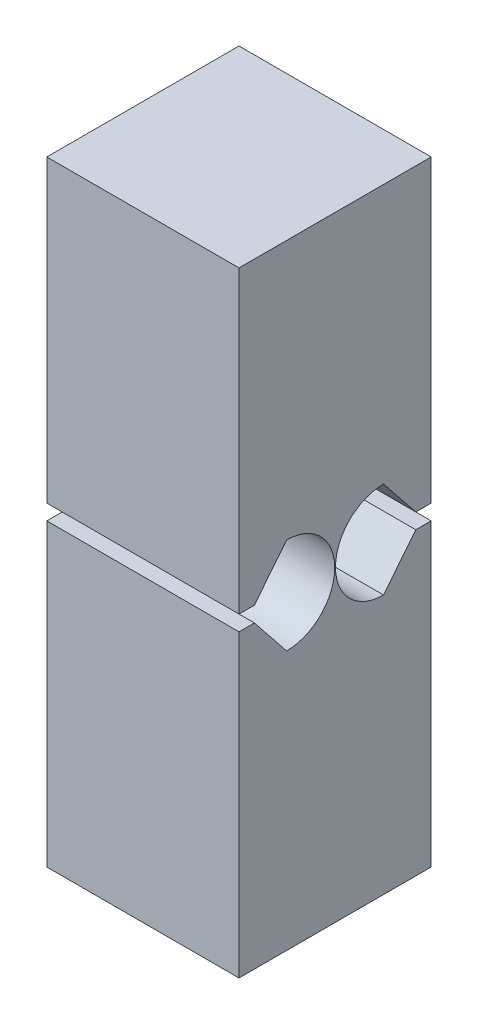
ISO-10303-21;
HEADER;
FILE_DESCRIPTION(('STEP AP214'),'2;1');
FILE_NAME('part.step','',(''),(''),'','','');
FILE_SCHEMA(('AUTOMOTIVE_DESIGN { 1 0 10303 214 1 1 1 1 }'));
ENDSEC;
DATA;
#1=APPLICATION_CONTEXT('core data for automotive mechanical design processes');
#2=APPLICATION_PROTOCOL_DEFINITION('international standard','automotive_design',2000,#1);
#3=PRODUCT_CONTEXT('',#1,'mechanical');
#4=PRODUCT('Part','Part','',(#3));
#5=PRODUCT_RELATED_PRODUCT_CATEGORY('part','',(#4));
#6=PRODUCT_DEFINITION_FORMATION('','',#4);
#7=PRODUCT_DEFINITION_CONTEXT('part definition',#1,'design');
#8=PRODUCT_DEFINITION('design','',#6,#7);
#9=PRODUCT_DEFINITION_SHAPE('','',#8);
#10=(LENGTH_UNIT() NAMED_UNIT(*) SI_UNIT(.MILLI.,.METRE.));
#11=(NAMED_UNIT(*) PLANE_ANGLE_UNIT() SI_UNIT($,.RADIAN.));
#12=(NAMED_UNIT(*) SI_UNIT($,.STERADIAN.) SOLID_ANGLE_UNIT());
#13=UNCERTAINTY_MEASURE_WITH_UNIT(LENGTH_MEASURE(1.E-05),#10,'distance_accuracy_value','');
#14=(GEOMETRIC_REPRESENTATION_CONTEXT(3) GLOBAL_UNCERTAINTY_ASSIGNED_CONTEXT((#13)) GLOBAL_UNIT_ASSIGNED_CONTEXT((#10,
#11,#12)) REPRESENTATION_CONTEXT('',''));
#15=CARTESIAN_POINT('',(0.,0.,0.));
#16=DIRECTION('',(0.,0.,1.));
#17=DIRECTION('',(1.,0.,0.));
#18=AXIS2_PLACEMENT_3D('',#15,#16,#17);
#19=CARTESIAN_POINT('',(-3.175,10.16,-3.175));
#20=DIRECTION('',(1.,0.,0.));
#21=DIRECTION('',(0.,0.,-1.));
#22=AXIS2_PLACEMENT_3D('',#19,#20,#21);
#23=PLANE('',#22);
#24=DIRECTION('',(0.,0.,1.));
#25=VECTOR('',#24,1.);
#26=CARTESIAN_POINT('',(-3.175,0.254,-3.175));
#27=LINE('',#26,#25);
#28=CARTESIAN_POINT('',(-3.175,0.254000000000001,-3.175));
#29=VERTEX_POINT('',#28);
#30=CARTESIAN_POINT('',(-3.175,0.254,-2.667));
#31=VERTEX_POINT('',#30);
#32=EDGE_CURVE('E146',#29,#31,#27,.T.);
#33=ORIENTED_EDGE('',*,*,#32,.T.);
#34=DIRECTION('',(0.,0.78086880944303,0.624695047554424));
#35=VECTOR('',#34,1.);
#36=CARTESIAN_POINT('',(-3.175,0.254,-2.667));
#37=LINE('',#36,#35);
#38=CARTESIAN_POINT('',(-3.175,1.5875,-1.6002));
#39=VERTEX_POINT('',#38);
#40=EDGE_CURVE('E157',#31,#39,#37,.T.);
#41=ORIENTED_EDGE('',*,*,#40,.T.);
#42=CARTESIAN_POINT('',(-3.175,0.,-1.6002));
#43=DIRECTION('',(1.,0.,0.));
#44=DIRECTION('',(0.,0.,-1.));
#45=AXIS2_PLACEMENT_3D('',#42,#43,#44);
#46=CIRCLE('',#45,1.5875);
#47=CARTESIAN_POINT('',(-3.175,-1.5875,-1.6002));
#48=VERTEX_POINT('',#47);
#49=EDGE_CURVE('E281',#39,#48,#46,.T.);
#50=ORIENTED_EDGE('',*,*,#49,.T.);
#51=DIRECTION('',(0.,0.78086880944303,-0.624695047554424));
#52=VECTOR('',#51,1.);
#53=CARTESIAN_POINT('',(-3.175,-0.254,-2.667));
#54=LINE('',#53,#52);
#55=CARTESIAN_POINT('',(-3.175,-0.254,-2.667));
#56=VERTEX_POINT('',#55);
#57=EDGE_CURVE('E258',#48,#56,#54,.T.);
#58=ORIENTED_EDGE('',*,*,#57,.T.);
#59=DIRECTION('',(0.,0.,-1.));
#60=VECTOR('',#59,1.);
#61=CARTESIAN_POINT('',(-3.175,-0.254,-3.175));
#62=LINE('',#61,#60);
#63=CARTESIAN_POINT('',(-3.175,-0.254000000000001,-3.175));
#64=VERTEX_POINT('',#63);
#65=EDGE_CURVE('E284',#56,#64,#62,.T.);
#66=ORIENTED_EDGE('',*,*,#65,.T.);
#67=DIRECTION('',(0.,-1.,0.));
#68=VECTOR('',#67,1.);
#69=CARTESIAN_POINT('',(-3.175,10.16,-3.175));
#70=LINE('',#69,#68);
#71=CARTESIAN_POINT('',(-3.175,-10.16,-3.175));
#72=VERTEX_POINT('',#71);
#73=EDGE_CURVE('E174',#64,#72,#70,.T.);
#74=ORIENTED_EDGE('',*,*,#73,.T.);
#75=DIRECTION('',(0.,0.,1.));
#76=VECTOR('',#75,1.);
#77=CARTESIAN_POINT('',(-3.175,-10.16,-3.175));
#78=LINE('',#77,#76);
#79=CARTESIAN_POINT('',(-3.175,-10.16,3.175));
#80=VERTEX_POINT('',#79);
#81=EDGE_CURVE('E209',#72,#80,#78,.T.);
#82=ORIENTED_EDGE('',*,*,#81,.T.);
#83=DIRECTION('',(0.,-1.,0.));
#84=VECTOR('',#83,1.);
#85=CARTESIAN_POINT('',(-3.175,10.16,3.175));
#86=LINE('',#85,#84);
#87=CARTESIAN_POINT('',(-3.175,-0.254,3.175));
#88=VERTEX_POINT('',#87);
#89=EDGE_CURVE('E41',#88,#80,#86,.T.);
#90=ORIENTED_EDGE('',*,*,#89,.F.);
#91=DIRECTION('',(0.,0.,1.));
#92=VECTOR('',#91,1.);
#93=CARTESIAN_POINT('',(-3.175,-0.254,3.175));
#94=LINE('',#93,#92);
#95=CARTESIAN_POINT('',(-3.175,-0.254,2.667));
#96=VERTEX_POINT('',#95);
#97=EDGE_CURVE('E247',#96,#88,#94,.T.);
#98=ORIENTED_EDGE('',*,*,#97,.F.);
#99=DIRECTION('',(0.,0.78086880944303,0.624695047554424));
#100=VECTOR('',#99,1.);
#101=CARTESIAN_POINT('',(-3.175,-0.254,2.667));
#102=LINE('',#101,#100);
#103=CARTESIAN_POINT('',(-3.175,-1.5875,1.6002));
#104=VERTEX_POINT('',#103);
#105=EDGE_CURVE('E249',#104,#96,#102,.T.);
#106=ORIENTED_EDGE('',*,*,#105,.F.);
#107=CARTESIAN_POINT('',(-3.175,0.,1.6002));
#108=DIRECTION('',(1.,0.,0.));
#109=DIRECTION('',(0.,0.,-1.));
#110=AXIS2_PLACEMENT_3D('',#107,#108,#109);
#111=CIRCLE('',#110,1.5875);
#112=CARTESIAN_POINT('',(-3.175,1.5875,1.6002));
#113=VERTEX_POINT('',#112);
#114=EDGE_CURVE('E252',#113,#104,#111,.F.);
#115=ORIENTED_EDGE('',*,*,#114,.F.);
#116=DIRECTION('',(0.,0.78086880944303,-0.624695047554424));
#117=VECTOR('',#116,1.);
#118=CARTESIAN_POINT('',(-3.175,0.254,2.667));
#119=LINE('',#118,#117);
#120=CARTESIAN_POINT('',(-3.175,0.254,2.667));
#121=VERTEX_POINT('',#120);
#122=EDGE_CURVE('E215',#121,#113,#119,.T.);
#123=ORIENTED_EDGE('',*,*,#122,.F.);
#124=DIRECTION('',(0.,0.,-1.));
#125=VECTOR('',#124,1.);
#126=CARTESIAN_POINT('',(-3.175,0.254,3.175));
#127=LINE('',#126,#125);
#128=CARTESIAN_POINT('',(-3.175,0.254,3.175));
#129=VERTEX_POINT('',#128);
#130=EDGE_CURVE('E255',#129,#121,#127,.T.);
#131=ORIENTED_EDGE('',*,*,#130,.F.);
#132=CARTESIAN_POINT('',(-3.175,10.16,3.175));
#133=VERTEX_POINT('',#132);
#134=EDGE_CURVE('E11',#133,#129,#86,.T.);
#135=ORIENTED_EDGE('',*,*,#134,.F.);
#136=DIRECTION('',(0.,0.,1.));
#137=VECTOR('',#136,1.);
#138=CARTESIAN_POINT('',(-3.175,10.16,-3.175));
#139=LINE('',#138,#137);
#140=CARTESIAN_POINT('',(-3.175,10.16,-3.175));
#141=VERTEX_POINT('',#140);
#142=EDGE_CURVE('E172',#141,#133,#139,.T.);
#143=ORIENTED_EDGE('',*,*,#142,.F.);
#144=EDGE_CURVE('E164',#141,#29,#70,.T.);
#145=ORIENTED_EDGE('',*,*,#144,.T.);
#146=EDGE_LOOP('',(#33,#41,#50,#58,#66,#74,#82,#90,#98,#106,#115,#123,#131,#135,#143,#145));
#147=FACE_BOUND('',#146,.T.);
#148=ADVANCED_FACE('F34',(#147),#23,.F.);
#149=CARTESIAN_POINT('',(3.175,10.16,-3.175));
#150=DIRECTION('',(-1.,0.,0.));
#151=DIRECTION('',(0.,0.,1.));
#152=AXIS2_PLACEMENT_3D('',#149,#150,#151);
#153=PLANE('',#152);
#154=DIRECTION('',(0.,0.,-1.));
#155=VECTOR('',#154,1.);
#156=CARTESIAN_POINT('',(3.175,0.254,-3.175));
#157=LINE('',#156,#155);
#158=CARTESIAN_POINT('',(3.175,0.254,-2.667));
#159=VERTEX_POINT('',#158);
#160=CARTESIAN_POINT('',(3.175,0.254,-3.175));
#161=VERTEX_POINT('',#160);
#162=EDGE_CURVE('E272',#159,#161,#157,.T.);
#163=ORIENTED_EDGE('',*,*,#162,.T.);
#164=DIRECTION('',(0.,-1.,0.));
#165=VECTOR('',#164,1.);
#166=CARTESIAN_POINT('',(3.175,10.16,-3.175));
#167=LINE('',#166,#165);
#168=CARTESIAN_POINT('',(3.175,10.16,-3.175));
#169=VERTEX_POINT('',#168);
#170=EDGE_CURVE('E167',#169,#161,#167,.T.);
#171=ORIENTED_EDGE('',*,*,#170,.F.);
#172=DIRECTION('',(0.,0.,-1.));
#173=VECTOR('',#172,1.);
#174=CARTESIAN_POINT('',(3.175,10.16,-3.175));
#175=LINE('',#174,#173);
#176=CARTESIAN_POINT('',(3.175,10.16,3.175));
#177=VERTEX_POINT('',#176);
#178=EDGE_CURVE('E217',#177,#169,#175,.T.);
#179=ORIENTED_EDGE('',*,*,#178,.F.);
#180=DIRECTION('',(0.,-1.,0.));
#181=VECTOR('',#180,1.);
#182=CARTESIAN_POINT('',(3.175,10.16,3.175));
#183=LINE('',#182,#181);
#184=CARTESIAN_POINT('',(3.175,0.254,3.175));
#185=VERTEX_POINT('',#184);
#186=EDGE_CURVE('E182',#177,#185,#183,.T.);
#187=ORIENTED_EDGE('',*,*,#186,.T.);
#188=DIRECTION('',(0.,0.,1.));
#189=VECTOR('',#188,1.);
#190=CARTESIAN_POINT('',(3.175,0.254,3.175));
#191=LINE('',#190,#189);
#192=CARTESIAN_POINT('',(3.175,0.254,2.667));
#193=VERTEX_POINT('',#192);
#194=EDGE_CURVE('E241',#193,#185,#191,.T.);
#195=ORIENTED_EDGE('',*,*,#194,.F.);
#196=DIRECTION('',(0.,-0.78086880944303,0.624695047554424));
#197=VECTOR('',#196,1.);
#198=CARTESIAN_POINT('',(3.175,0.254,2.667));
#199=LINE('',#198,#197);
#200=CARTESIAN_POINT('',(3.175,1.5875,1.6002));
#201=VERTEX_POINT('',#200);
#202=EDGE_CURVE('E243',#201,#193,#199,.T.);
#203=ORIENTED_EDGE('',*,*,#202,.F.);
#204=CARTESIAN_POINT('',(3.175,0.,1.6002));
#205=DIRECTION('',(1.,0.,0.));
#206=DIRECTION('',(0.,0.,1.));
#207=AXIS2_PLACEMENT_3D('',#204,#205,#206);
#208=CIRCLE('',#207,1.5875);
#209=CARTESIAN_POINT('',(3.175,-1.5875,1.6002));
#210=VERTEX_POINT('',#209);
#211=EDGE_CURVE('E56',#210,#201,#208,.T.);
#212=ORIENTED_EDGE('',*,*,#211,.F.);
#213=DIRECTION('',(0.,-0.78086880944303,-0.624695047554424));
#214=VECTOR('',#213,1.);
#215=CARTESIAN_POINT('',(3.175,-0.254,2.667));
#216=LINE('',#215,#214);
#217=CARTESIAN_POINT('',(3.175,-0.254,2.667));
#218=VERTEX_POINT('',#217);
#219=EDGE_CURVE('E228',#218,#210,#216,.T.);
#220=ORIENTED_EDGE('',*,*,#219,.F.);
#221=DIRECTION('',(0.,0.,-1.));
#222=VECTOR('',#221,1.);
#223=CARTESIAN_POINT('',(3.175,-0.254,3.175));
#224=LINE('',#223,#222);
#225=CARTESIAN_POINT('',(3.175,-0.254,3.175));
#226=VERTEX_POINT('',#225);
#227=EDGE_CURVE('E199',#226,#218,#224,.T.);
#228=ORIENTED_EDGE('',*,*,#227,.F.);
#229=CARTESIAN_POINT('',(3.175,-10.16,3.175));
#230=VERTEX_POINT('',#229);
#231=EDGE_CURVE('E181',#226,#230,#183,.T.);
#232=ORIENTED_EDGE('',*,*,#231,.T.);
#233=DIRECTION('',(0.,0.,-1.));
#234=VECTOR('',#233,1.);
#235=CARTESIAN_POINT('',(3.175,-10.16,-3.175));
#236=LINE('',#235,#234);
#237=CARTESIAN_POINT('',(3.175,-10.16,-3.175));
#238=VERTEX_POINT('',#237);
#239=EDGE_CURVE('E195',#230,#238,#236,.T.);
#240=ORIENTED_EDGE('',*,*,#239,.T.);
#241=CARTESIAN_POINT('',(3.175,-0.254000000000001,-3.175));
#242=VERTEX_POINT('',#241);
#243=EDGE_CURVE('E173',#242,#238,#167,.T.);
#244=ORIENTED_EDGE('',*,*,#243,.F.);
#245=DIRECTION('',(0.,0.,1.));
#246=VECTOR('',#245,1.);
#247=CARTESIAN_POINT('',(3.175,-0.254,-3.175));
#248=LINE('',#247,#246);
#249=CARTESIAN_POINT('',(3.175,-0.254,-2.667));
#250=VERTEX_POINT('',#249);
#251=EDGE_CURVE('E48',#242,#250,#248,.T.);
#252=ORIENTED_EDGE('',*,*,#251,.T.);
#253=DIRECTION('',(0.,-0.78086880944303,0.624695047554424));
#254=VECTOR('',#253,1.);
#255=CARTESIAN_POINT('',(3.175,-0.254,-2.667));
#256=LINE('',#255,#254);
#257=CARTESIAN_POINT('',(3.175,-1.5875,-1.6002));
#258=VERTEX_POINT('',#257);
#259=EDGE_CURVE('E275',#250,#258,#256,.T.);
#260=ORIENTED_EDGE('',*,*,#259,.T.);
#261=CARTESIAN_POINT('',(3.175,0.,-1.6002));
#262=DIRECTION('',(-1.,0.,0.));
#263=DIRECTION('',(0.,0.,-1.));
#264=AXIS2_PLACEMENT_3D('',#261,#262,#263);
#265=CIRCLE('',#264,1.5875);
#266=CARTESIAN_POINT('',(3.175,1.5875,-1.6002));
#267=VERTEX_POINT('',#266);
#268=EDGE_CURVE('E156',#258,#267,#265,.T.);
#269=ORIENTED_EDGE('',*,*,#268,.T.);
#270=DIRECTION('',(0.,-0.78086880944303,-0.624695047554424));
#271=VECTOR('',#270,1.);
#272=CARTESIAN_POINT('',(3.175,0.254,-2.667));
#273=LINE('',#272,#271);
#274=EDGE_CURVE('E265',#267,#159,#273,.T.);
#275=ORIENTED_EDGE('',*,*,#274,.T.);
#276=EDGE_LOOP('',(#163,#171,#179,#187,#195,#203,#212,#220,#228,#232,#240,#244,#252,#260,#269,#275));
#277=FACE_BOUND('',#276,.T.);
#278=ADVANCED_FACE('F192',(#277),#153,.F.);
#279=CARTESIAN_POINT('',(-3.175,10.16,-3.175));
#280=DIRECTION('',(0.,0.,1.));
#281=DIRECTION('',(1.,0.,0.));
#282=AXIS2_PLACEMENT_3D('',#279,#280,#281);
#283=PLANE('',#282);
#284=DIRECTION('',(1.,0.,0.));
#285=VECTOR('',#284,1.);
#286=CARTESIAN_POINT('',(-3.176,0.254,-3.175));
#287=LINE('',#286,#285);
#288=EDGE_CURVE('E150',#29,#161,#287,.T.);
#289=ORIENTED_EDGE('',*,*,#288,.F.);
#290=ORIENTED_EDGE('',*,*,#144,.F.);
#291=DIRECTION('',(-1.,0.,0.));
#292=VECTOR('',#291,1.);
#293=CARTESIAN_POINT('',(-3.175,10.16,-3.175));
#294=LINE('',#293,#292);
#295=EDGE_CURVE('E177',#169,#141,#294,.T.);
#296=ORIENTED_EDGE('',*,*,#295,.F.);
#297=ORIENTED_EDGE('',*,*,#170,.T.);
#298=EDGE_LOOP('',(#289,#290,#296,#297));
#299=FACE_BOUND('',#298,.T.);
#300=ADVANCED_FACE('F162',(#299),#283,.F.);
#301=DIRECTION('',(1.,0.,0.));
#302=VECTOR('',#301,1.);
#303=CARTESIAN_POINT('',(-3.176,-0.254,-3.175));
#304=LINE('',#303,#302);
#305=EDGE_CURVE('E168',#64,#242,#304,.T.);
#306=ORIENTED_EDGE('',*,*,#305,.T.);
#307=ORIENTED_EDGE('',*,*,#243,.T.);
#308=DIRECTION('',(-1.,0.,0.));
#309=VECTOR('',#308,1.);
#310=CARTESIAN_POINT('',(-3.175,-10.16,-3.175));
#311=LINE('',#310,#309);
#312=EDGE_CURVE('E179',#238,#72,#311,.T.);
#313=ORIENTED_EDGE('',*,*,#312,.T.);
#314=ORIENTED_EDGE('',*,*,#73,.F.);
#315=EDGE_LOOP('',(#306,#307,#313,#314));
#316=FACE_BOUND('',#315,.T.);
#317=ADVANCED_FACE('F289',(#316),#283,.F.);
#318=CARTESIAN_POINT('',(-3.175,10.16,3.175));
#319=DIRECTION('',(0.,0.,-1.));
#320=DIRECTION('',(-1.,0.,0.));
#321=AXIS2_PLACEMENT_3D('',#318,#319,#320);
#322=PLANE('',#321);
#323=ORIENTED_EDGE('',*,*,#231,.F.);
#324=DIRECTION('',(1.,0.,0.));
#325=VECTOR('',#324,1.);
#326=CARTESIAN_POINT('',(-3.176,-0.254,3.175));
#327=LINE('',#326,#325);
#328=EDGE_CURVE('E233',#88,#226,#327,.T.);
#329=ORIENTED_EDGE('',*,*,#328,.F.);
#330=ORIENTED_EDGE('',*,*,#89,.T.);
#331=DIRECTION('',(1.,0.,0.));
#332=VECTOR('',#331,1.);
#333=CARTESIAN_POINT('',(-3.175,-10.16,3.175));
#334=LINE('',#333,#332);
#335=EDGE_CURVE('E203',#80,#230,#334,.T.);
#336=ORIENTED_EDGE('',*,*,#335,.T.);
#337=EDGE_LOOP('',(#323,#329,#330,#336));
#338=FACE_BOUND('',#337,.T.);
#339=ADVANCED_FACE('F204',(#338),#322,.F.);
#340=ORIENTED_EDGE('',*,*,#134,.T.);
#341=DIRECTION('',(1.,0.,0.));
#342=VECTOR('',#341,1.);
#343=CARTESIAN_POINT('',(-3.176,0.254,3.175));
#344=LINE('',#343,#342);
#345=EDGE_CURVE('E230',#129,#185,#344,.T.);
#346=ORIENTED_EDGE('',*,*,#345,.T.);
#347=ORIENTED_EDGE('',*,*,#186,.F.);
#348=DIRECTION('',(1.,0.,0.));
#349=VECTOR('',#348,1.);
#350=CARTESIAN_POINT('',(-3.175,10.16,3.175));
#351=LINE('',#350,#349);
#352=EDGE_CURVE('E219',#133,#177,#351,.T.);
#353=ORIENTED_EDGE('',*,*,#352,.F.);
#354=EDGE_LOOP('',(#340,#346,#347,#353));
#355=FACE_BOUND('',#354,.T.);
#356=ADVANCED_FACE('F306',(#355),#322,.F.);
#357=CARTESIAN_POINT('',(0.,10.16,0.));
#358=DIRECTION('',(0.,1.,0.));
#359=DIRECTION('',(0.,0.,1.));
#360=AXIS2_PLACEMENT_3D('',#357,#358,#359);
#361=PLANE('',#360);
#362=ORIENTED_EDGE('',*,*,#142,.T.);
#363=ORIENTED_EDGE('',*,*,#352,.T.);
#364=ORIENTED_EDGE('',*,*,#178,.T.);
#365=ORIENTED_EDGE('',*,*,#295,.T.);
#366=EDGE_LOOP('',(#362,#363,#364,#365));
#367=FACE_BOUND('',#366,.T.);
#368=ADVANCED_FACE('F308',(#367),#361,.T.);
#369=CARTESIAN_POINT('',(0.,-10.16,0.));
#370=DIRECTION('',(0.,1.,0.));
#371=DIRECTION('',(0.,0.,1.));
#372=AXIS2_PLACEMENT_3D('',#369,#370,#371);
#373=PLANE('',#372);
#374=ORIENTED_EDGE('',*,*,#81,.F.);
#375=ORIENTED_EDGE('',*,*,#312,.F.);
#376=ORIENTED_EDGE('',*,*,#239,.F.);
#377=ORIENTED_EDGE('',*,*,#335,.F.);
#378=EDGE_LOOP('',(#374,#375,#376,#377));
#379=FACE_BOUND('',#378,.T.);
#380=ADVANCED_FACE('F211',(#379),#373,.F.);
#381=CARTESIAN_POINT('',(-3.176,0.,1.6002));
#382=DIRECTION('',(1.,0.,0.));
#383=DIRECTION('',(0.,0.,-1.));
#384=AXIS2_PLACEMENT_3D('',#381,#382,#383);
#385=CYLINDRICAL_SURFACE('',#384,1.5875);
#386=ORIENTED_EDGE('',*,*,#114,.T.);
#387=DIRECTION('',(1.,0.,0.));
#388=VECTOR('',#387,1.);
#389=CARTESIAN_POINT('',(-3.176,-1.5875,1.6002));
#390=LINE('',#389,#388);
#391=EDGE_CURVE('E224',#104,#210,#390,.T.);
#392=ORIENTED_EDGE('',*,*,#391,.T.);
#393=ORIENTED_EDGE('',*,*,#211,.T.);
#394=DIRECTION('',(1.,0.,0.));
#395=VECTOR('',#394,1.);
#396=CARTESIAN_POINT('',(-3.176,1.5875,1.6002));
#397=LINE('',#396,#395);
#398=EDGE_CURVE('E225',#113,#201,#397,.T.);
#399=ORIENTED_EDGE('',*,*,#398,.F.);
#400=EDGE_LOOP('',(#386,#392,#393,#399));
#401=FACE_BOUND('',#400,.T.);
#402=ADVANCED_FACE('F297',(#401),#385,.F.);
#403=CARTESIAN_POINT('',(-3.176,-0.254,2.667));
#404=DIRECTION('',(0.,-0.624695047554424,0.78086880944303));
#405=DIRECTION('',(0.,-0.78086880944303,-0.624695047554424));
#406=AXIS2_PLACEMENT_3D('',#403,#404,#405);
#407=PLANE('',#406);
#408=ORIENTED_EDGE('',*,*,#105,.T.);
#409=DIRECTION('',(1.,0.,0.));
#410=VECTOR('',#409,1.);
#411=CARTESIAN_POINT('',(-3.176,-0.254,2.667));
#412=LINE('',#411,#410);
#413=EDGE_CURVE('E235',#96,#218,#412,.T.);
#414=ORIENTED_EDGE('',*,*,#413,.T.);
#415=ORIENTED_EDGE('',*,*,#219,.T.);
#416=ORIENTED_EDGE('',*,*,#391,.F.);
#417=EDGE_LOOP('',(#408,#414,#415,#416));
#418=FACE_BOUND('',#417,.T.);
#419=ADVANCED_FACE('F296',(#418),#407,.F.);
#420=CARTESIAN_POINT('',(-3.176,-0.254,3.175));
#421=DIRECTION('',(0.,-1.,0.));
#422=DIRECTION('',(0.,0.,-1.));
#423=AXIS2_PLACEMENT_3D('',#420,#421,#422);
#424=PLANE('',#423);
#425=ORIENTED_EDGE('',*,*,#97,.T.);
#426=ORIENTED_EDGE('',*,*,#328,.T.);
#427=ORIENTED_EDGE('',*,*,#227,.T.);
#428=ORIENTED_EDGE('',*,*,#413,.F.);
#429=EDGE_LOOP('',(#425,#426,#427,#428));
#430=FACE_BOUND('',#429,.T.);
#431=ADVANCED_FACE('F294',(#430),#424,.F.);
#432=CARTESIAN_POINT('',(-3.176,0.254,3.175));
#433=DIRECTION('',(0.,1.,0.));
#434=DIRECTION('',(0.,0.,1.));
#435=AXIS2_PLACEMENT_3D('',#432,#433,#434);
#436=PLANE('',#435);
#437=ORIENTED_EDGE('',*,*,#130,.T.);
#438=DIRECTION('',(1.,0.,0.));
#439=VECTOR('',#438,1.);
#440=CARTESIAN_POINT('',(-3.176,0.254,2.667));
#441=LINE('',#440,#439);
#442=EDGE_CURVE('E227',#121,#193,#441,.T.);
#443=ORIENTED_EDGE('',*,*,#442,.T.);
#444=ORIENTED_EDGE('',*,*,#194,.T.);
#445=ORIENTED_EDGE('',*,*,#345,.F.);
#446=EDGE_LOOP('',(#437,#443,#444,#445));
#447=FACE_BOUND('',#446,.T.);
#448=ADVANCED_FACE('F304',(#447),#436,.F.);
#449=CARTESIAN_POINT('',(-3.176,0.254,2.667));
#450=DIRECTION('',(0.,0.624695047554424,0.78086880944303));
#451=DIRECTION('',(0.,-0.78086880944303,0.624695047554424));
#452=AXIS2_PLACEMENT_3D('',#449,#450,#451);
#453=PLANE('',#452);
#454=ORIENTED_EDGE('',*,*,#122,.T.);
#455=ORIENTED_EDGE('',*,*,#398,.T.);
#456=ORIENTED_EDGE('',*,*,#202,.T.);
#457=ORIENTED_EDGE('',*,*,#442,.F.);
#458=EDGE_LOOP('',(#454,#455,#456,#457));
#459=FACE_BOUND('',#458,.T.);
#460=ADVANCED_FACE('F301',(#459),#453,.F.);
#461=CARTESIAN_POINT('',(-3.176,0.,-1.6002));
#462=DIRECTION('',(1.,0.,0.));
#463=DIRECTION('',(0.,0.,-1.));
#464=AXIS2_PLACEMENT_3D('',#461,#462,#463);
#465=CYLINDRICAL_SURFACE('',#464,1.5875);
#466=DIRECTION('',(1.,0.,0.));
#467=VECTOR('',#466,1.);
#468=CARTESIAN_POINT('',(-3.176,1.5875,-1.6002));
#469=LINE('',#468,#467);
#470=EDGE_CURVE('E261',#39,#267,#469,.T.);
#471=ORIENTED_EDGE('',*,*,#470,.T.);
#472=ORIENTED_EDGE('',*,*,#268,.F.);
#473=DIRECTION('',(1.,0.,0.));
#474=VECTOR('',#473,1.);
#475=CARTESIAN_POINT('',(-3.176,-1.5875,-1.6002));
#476=LINE('',#475,#474);
#477=EDGE_CURVE('E262',#48,#258,#476,.T.);
#478=ORIENTED_EDGE('',*,*,#477,.F.);
#479=ORIENTED_EDGE('',*,*,#49,.F.);
#480=EDGE_LOOP('',(#471,#472,#478,#479));
#481=FACE_BOUND('',#480,.T.);
#482=ADVANCED_FACE('F316',(#481),#465,.F.);
#483=CARTESIAN_POINT('',(-3.176,0.254,-2.667));
#484=DIRECTION('',(0.,-0.624695047554424,0.78086880944303));
#485=DIRECTION('',(0.,-0.78086880944303,-0.624695047554424));
#486=AXIS2_PLACEMENT_3D('',#483,#484,#485);
#487=PLANE('',#486);
#488=DIRECTION('',(1.,0.,0.));
#489=VECTOR('',#488,1.);
#490=CARTESIAN_POINT('',(-3.176,0.254,-2.667));
#491=LINE('',#490,#489);
#492=EDGE_CURVE('E152',#31,#159,#491,.T.);
#493=ORIENTED_EDGE('',*,*,#492,.T.);
#494=ORIENTED_EDGE('',*,*,#274,.F.);
#495=ORIENTED_EDGE('',*,*,#470,.F.);
#496=ORIENTED_EDGE('',*,*,#40,.F.);
#497=EDGE_LOOP('',(#493,#494,#495,#496));
#498=FACE_BOUND('',#497,.T.);
#499=ADVANCED_FACE('F313',(#498),#487,.T.);
#500=CARTESIAN_POINT('',(-3.176,0.254,-3.175));
#501=DIRECTION('',(0.,-1.,0.));
#502=DIRECTION('',(0.,0.,-1.));
#503=AXIS2_PLACEMENT_3D('',#500,#501,#502);
#504=PLANE('',#503);
#505=ORIENTED_EDGE('',*,*,#288,.T.);
#506=ORIENTED_EDGE('',*,*,#162,.F.);
#507=ORIENTED_EDGE('',*,*,#492,.F.);
#508=ORIENTED_EDGE('',*,*,#32,.F.);
#509=EDGE_LOOP('',(#505,#506,#507,#508));
#510=FACE_BOUND('',#509,.T.);
#511=ADVANCED_FACE('F148',(#510),#504,.T.);
#512=CARTESIAN_POINT('',(-3.176,-0.254,-3.175));
#513=DIRECTION('',(0.,1.,0.));
#514=DIRECTION('',(0.,0.,1.));
#515=AXIS2_PLACEMENT_3D('',#512,#513,#514);
#516=PLANE('',#515);
#517=DIRECTION('',(1.,0.,0.));
#518=VECTOR('',#517,1.);
#519=CARTESIAN_POINT('',(-3.176,-0.254,-2.667));
#520=LINE('',#519,#518);
#521=EDGE_CURVE('E264',#56,#250,#520,.T.);
#522=ORIENTED_EDGE('',*,*,#521,.T.);
#523=ORIENTED_EDGE('',*,*,#251,.F.);
#524=ORIENTED_EDGE('',*,*,#305,.F.);
#525=ORIENTED_EDGE('',*,*,#65,.F.);
#526=EDGE_LOOP('',(#522,#523,#524,#525));
#527=FACE_BOUND('',#526,.T.);
#528=ADVANCED_FACE('F320',(#527),#516,.T.);
#529=CARTESIAN_POINT('',(-3.176,-0.254,-2.667));
#530=DIRECTION('',(0.,0.624695047554424,0.78086880944303));
#531=DIRECTION('',(0.,-0.78086880944303,0.624695047554424));
#532=AXIS2_PLACEMENT_3D('',#529,#530,#531);
#533=PLANE('',#532);
#534=ORIENTED_EDGE('',*,*,#477,.T.);
#535=ORIENTED_EDGE('',*,*,#259,.F.);
#536=ORIENTED_EDGE('',*,*,#521,.F.);
#537=ORIENTED_EDGE('',*,*,#57,.F.);
#538=EDGE_LOOP('',(#534,#535,#536,#537));
#539=FACE_BOUND('',#538,.T.);
#540=ADVANCED_FACE('F319',(#539),#533,.T.);
#541=CLOSED_SHELL('',(#148,#278,#300,#317,#339,#356,#368,#380,#402,#419,#431,#448,#460,#482,
#499,#511,#528,#540));
#542=MANIFOLD_SOLID_BREP('B2',#541);
#543=ADVANCED_BREP_SHAPE_REPRESENTATION('',(#18,#542),#14);
#544=SHAPE_DEFINITION_REPRESENTATION(#9,#543);
ENDSEC;
END-ISO-10303-21;
